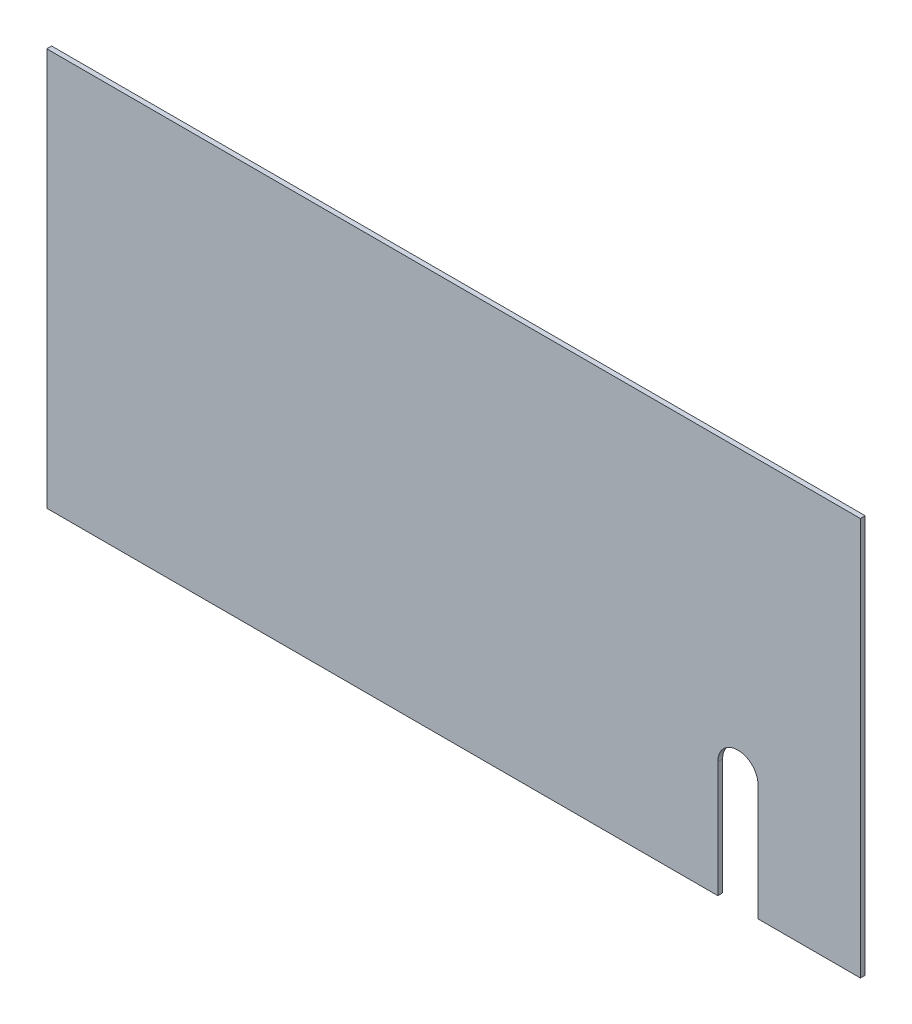
ISO-10303-21;
HEADER;
FILE_DESCRIPTION(('STEP AP214'),'2;1');
FILE_NAME('part.step','',(''),(''),'','','');
FILE_SCHEMA(('AUTOMOTIVE_DESIGN { 1 0 10303 214 1 1 1 1 }'));
ENDSEC;
DATA;
#1=APPLICATION_CONTEXT('core data for automotive mechanical design processes');
#2=APPLICATION_PROTOCOL_DEFINITION('international standard','automotive_design',2000,#1);
#3=PRODUCT_CONTEXT('',#1,'mechanical');
#4=PRODUCT('Part','Part','',(#3));
#5=PRODUCT_RELATED_PRODUCT_CATEGORY('part','',(#4));
#6=PRODUCT_DEFINITION_FORMATION('','',#4);
#7=PRODUCT_DEFINITION_CONTEXT('part definition',#1,'design');
#8=PRODUCT_DEFINITION('design','',#6,#7);
#9=PRODUCT_DEFINITION_SHAPE('','',#8);
#10=(LENGTH_UNIT() NAMED_UNIT(*) SI_UNIT(.MILLI.,.METRE.));
#11=(NAMED_UNIT(*) PLANE_ANGLE_UNIT() SI_UNIT($,.RADIAN.));
#12=(NAMED_UNIT(*) SI_UNIT($,.STERADIAN.) SOLID_ANGLE_UNIT());
#13=UNCERTAINTY_MEASURE_WITH_UNIT(LENGTH_MEASURE(1.E-05),#10,'distance_accuracy_value','');
#14=(GEOMETRIC_REPRESENTATION_CONTEXT(3) GLOBAL_UNCERTAINTY_ASSIGNED_CONTEXT((#13)) GLOBAL_UNIT_ASSIGNED_CONTEXT((#10,
#11,#12)) REPRESENTATION_CONTEXT('',''));
#15=CARTESIAN_POINT('',(0.,0.,0.));
#16=DIRECTION('',(0.,0.,1.));
#17=DIRECTION('',(1.,0.,0.));
#18=AXIS2_PLACEMENT_3D('',#15,#16,#17);
#19=CARTESIAN_POINT('',(230.5,-2.16617363985669,3.));
#20=DIRECTION('',(0.,1.,0.));
#21=DIRECTION('',(-1.,0.,0.));
#22=AXIS2_PLACEMENT_3D('',#19,#20,#21);
#23=PLANE('',#22);
#24=DIRECTION('',(1.,0.,0.));
#25=VECTOR('',#24,1.);
#26=CARTESIAN_POINT('',(230.5,-2.16617363985669,3.));
#27=LINE('',#26,#25);
#28=CARTESIAN_POINT('',(167.,-2.16617363985681,3.));
#29=VERTEX_POINT('',#28);
#30=CARTESIAN_POINT('',(230.5,-2.16617363985669,3.));
#31=VERTEX_POINT('',#30);
#32=EDGE_CURVE('E56',#29,#31,#27,.T.);
#33=ORIENTED_EDGE('',*,*,#32,.F.);
#34=DIRECTION('',(0.,0.,-1.));
#35=VECTOR('',#34,1.);
#36=CARTESIAN_POINT('',(167.,-2.16617363985671,3.));
#37=LINE('',#36,#35);
#38=CARTESIAN_POINT('',(167.,-2.16617363985682,0.));
#39=VERTEX_POINT('',#38);
#40=EDGE_CURVE('E132',#29,#39,#37,.T.);
#41=ORIENTED_EDGE('',*,*,#40,.T.);
#42=DIRECTION('',(1.,0.,0.));
#43=VECTOR('',#42,1.);
#44=CARTESIAN_POINT('',(230.5,-2.16617363985669,0.));
#45=LINE('',#44,#43);
#46=CARTESIAN_POINT('',(230.5,-2.16617363985669,0.));
#47=VERTEX_POINT('',#46);
#48=EDGE_CURVE('E78',#39,#47,#45,.T.);
#49=ORIENTED_EDGE('',*,*,#48,.T.);
#50=DIRECTION('',(0.,0.,-1.));
#51=VECTOR('',#50,1.);
#52=CARTESIAN_POINT('',(230.5,-2.16617363985669,3.));
#53=LINE('',#52,#51);
#54=EDGE_CURVE('E142',#31,#47,#53,.T.);
#55=ORIENTED_EDGE('',*,*,#54,.F.);
#56=EDGE_LOOP('',(#33,#41,#49,#55));
#57=FACE_BOUND('',#56,.T.);
#58=ADVANCED_FACE('F32',(#57),#23,.F.);
#59=CARTESIAN_POINT('',(230.5,-2.16617363985669,3.));
#60=DIRECTION('',(-1.,0.,0.));
#61=DIRECTION('',(0.,0.,1.));
#62=AXIS2_PLACEMENT_3D('',#59,#60,#61);
#63=PLANE('',#62);
#64=DIRECTION('',(0.,1.,0.));
#65=VECTOR('',#64,1.);
#66=CARTESIAN_POINT('',(230.5,-2.16617363985669,0.));
#67=LINE('',#66,#65);
#68=CARTESIAN_POINT('',(230.5,244.833826360143,0.));
#69=VERTEX_POINT('',#68);
#70=EDGE_CURVE('E134',#47,#69,#67,.T.);
#71=ORIENTED_EDGE('',*,*,#70,.T.);
#72=DIRECTION('',(0.,0.,-1.));
#73=VECTOR('',#72,1.);
#74=CARTESIAN_POINT('',(230.5,244.833826360143,3.));
#75=LINE('',#74,#73);
#76=CARTESIAN_POINT('',(230.5,244.833826360143,3.));
#77=VERTEX_POINT('',#76);
#78=EDGE_CURVE('E158',#77,#69,#75,.T.);
#79=ORIENTED_EDGE('',*,*,#78,.F.);
#80=DIRECTION('',(0.,1.,0.));
#81=VECTOR('',#80,1.);
#82=CARTESIAN_POINT('',(230.5,-2.16617363985669,3.));
#83=LINE('',#82,#81);
#84=EDGE_CURVE('E135',#31,#77,#83,.T.);
#85=ORIENTED_EDGE('',*,*,#84,.F.);
#86=ORIENTED_EDGE('',*,*,#54,.T.);
#87=EDGE_LOOP('',(#71,#79,#85,#86));
#88=FACE_BOUND('',#87,.T.);
#89=ADVANCED_FACE('F34',(#88),#63,.F.);
#90=CARTESIAN_POINT('',(230.5,244.833826360143,3.));
#91=DIRECTION('',(0.,-1.,0.));
#92=DIRECTION('',(1.,0.,0.));
#93=AXIS2_PLACEMENT_3D('',#90,#91,#92);
#94=PLANE('',#93);
#95=DIRECTION('',(-1.,0.,0.));
#96=VECTOR('',#95,1.);
#97=CARTESIAN_POINT('',(230.5,244.833826360143,0.));
#98=LINE('',#97,#96);
#99=CARTESIAN_POINT('',(-274.5,244.833826360143,0.));
#100=VERTEX_POINT('',#99);
#101=EDGE_CURVE('E145',#69,#100,#98,.T.);
#102=ORIENTED_EDGE('',*,*,#101,.T.);
#103=DIRECTION('',(0.,0.,-1.));
#104=VECTOR('',#103,1.);
#105=CARTESIAN_POINT('',(-274.5,244.833826360143,3.));
#106=LINE('',#105,#104);
#107=CARTESIAN_POINT('',(-274.5,244.833826360143,3.));
#108=VERTEX_POINT('',#107);
#109=EDGE_CURVE('E155',#108,#100,#106,.T.);
#110=ORIENTED_EDGE('',*,*,#109,.F.);
#111=DIRECTION('',(-1.,0.,0.));
#112=VECTOR('',#111,1.);
#113=CARTESIAN_POINT('',(230.5,244.833826360143,3.));
#114=LINE('',#113,#112);
#115=EDGE_CURVE('E86',#77,#108,#114,.T.);
#116=ORIENTED_EDGE('',*,*,#115,.F.);
#117=ORIENTED_EDGE('',*,*,#78,.T.);
#118=EDGE_LOOP('',(#102,#110,#116,#117));
#119=FACE_BOUND('',#118,.T.);
#120=ADVANCED_FACE('F171',(#119),#94,.F.);
#121=CARTESIAN_POINT('',(-274.5,-2.16617363985682,3.));
#122=DIRECTION('',(1.,0.,0.));
#123=DIRECTION('',(0.,0.,-1.));
#124=AXIS2_PLACEMENT_3D('',#121,#122,#123);
#125=PLANE('',#124);
#126=DIRECTION('',(0.,-1.,0.));
#127=VECTOR('',#126,1.);
#128=CARTESIAN_POINT('',(-274.5,-2.16617363985682,0.));
#129=LINE('',#128,#127);
#130=CARTESIAN_POINT('',(-274.5,-2.16617363985682,0.));
#131=VERTEX_POINT('',#130);
#132=EDGE_CURVE('E147',#100,#131,#129,.T.);
#133=ORIENTED_EDGE('',*,*,#132,.T.);
#134=DIRECTION('',(0.,0.,-1.));
#135=VECTOR('',#134,1.);
#136=CARTESIAN_POINT('',(-274.5,-2.16617363985682,3.));
#137=LINE('',#136,#135);
#138=CARTESIAN_POINT('',(-274.5,-2.16617363985682,3.));
#139=VERTEX_POINT('',#138);
#140=EDGE_CURVE('E152',#139,#131,#137,.T.);
#141=ORIENTED_EDGE('',*,*,#140,.F.);
#142=DIRECTION('',(0.,-1.,0.));
#143=VECTOR('',#142,1.);
#144=CARTESIAN_POINT('',(-274.5,-2.16617363985682,3.));
#145=LINE('',#144,#143);
#146=EDGE_CURVE('E139',#108,#139,#145,.T.);
#147=ORIENTED_EDGE('',*,*,#146,.F.);
#148=ORIENTED_EDGE('',*,*,#109,.T.);
#149=EDGE_LOOP('',(#133,#141,#147,#148));
#150=FACE_BOUND('',#149,.T.);
#151=ADVANCED_FACE('F174',(#150),#125,.F.);
#152=CARTESIAN_POINT('',(142.,-2.16617363985672,0.));
#153=VERTEX_POINT('',#152);
#154=EDGE_CURVE('E137',#131,#153,#45,.T.);
#155=ORIENTED_EDGE('',*,*,#154,.T.);
#156=DIRECTION('',(0.,0.,1.));
#157=VECTOR('',#156,1.);
#158=CARTESIAN_POINT('',(142.,-2.16617363985672,3.));
#159=LINE('',#158,#157);
#160=CARTESIAN_POINT('',(142.,-2.16617363985681,3.));
#161=VERTEX_POINT('',#160);
#162=EDGE_CURVE('E47',#153,#161,#159,.T.);
#163=ORIENTED_EDGE('',*,*,#162,.T.);
#164=EDGE_CURVE('E126',#139,#161,#27,.T.);
#165=ORIENTED_EDGE('',*,*,#164,.F.);
#166=ORIENTED_EDGE('',*,*,#140,.T.);
#167=EDGE_LOOP('',(#155,#163,#165,#166));
#168=FACE_BOUND('',#167,.T.);
#169=ADVANCED_FACE('F176',(#168),#23,.F.);
#170=CARTESIAN_POINT('',(0.,0.,3.));
#171=DIRECTION('',(0.,0.,1.));
#172=DIRECTION('',(1.,0.,0.));
#173=AXIS2_PLACEMENT_3D('',#170,#171,#172);
#174=PLANE('',#173);
#175=DIRECTION('',(0.,1.,0.));
#176=VECTOR('',#175,1.);
#177=CARTESIAN_POINT('',(167.,69.8338263601432,3.));
#178=LINE('',#177,#176);
#179=CARTESIAN_POINT('',(167.,69.8338263601432,3.));
#180=VERTEX_POINT('',#179);
#181=EDGE_CURVE('E115',#29,#180,#178,.T.);
#182=ORIENTED_EDGE('',*,*,#181,.F.);
#183=ORIENTED_EDGE('',*,*,#32,.T.);
#184=ORIENTED_EDGE('',*,*,#84,.T.);
#185=ORIENTED_EDGE('',*,*,#115,.T.);
#186=ORIENTED_EDGE('',*,*,#146,.T.);
#187=ORIENTED_EDGE('',*,*,#164,.T.);
#188=DIRECTION('',(0.,-1.,0.));
#189=VECTOR('',#188,1.);
#190=CARTESIAN_POINT('',(142.,69.8338263601432,3.));
#191=LINE('',#190,#189);
#192=CARTESIAN_POINT('',(142.,69.8338263601432,3.));
#193=VERTEX_POINT('',#192);
#194=EDGE_CURVE('E110',#193,#161,#191,.T.);
#195=ORIENTED_EDGE('',*,*,#194,.F.);
#196=CARTESIAN_POINT('',(154.5,69.8338263601432,3.));
#197=DIRECTION('',(0.,0.,1.));
#198=DIRECTION('',(1.,0.,0.));
#199=AXIS2_PLACEMENT_3D('',#196,#197,#198);
#200=CIRCLE('',#199,12.5);
#201=EDGE_CURVE('E118',#180,#193,#200,.T.);
#202=ORIENTED_EDGE('',*,*,#201,.F.);
#203=EDGE_LOOP('',(#182,#183,#184,#185,#186,#187,#195,#202));
#204=FACE_BOUND('',#203,.T.);
#205=ADVANCED_FACE('F124',(#204),#174,.T.);
#206=CARTESIAN_POINT('',(0.,0.,0.));
#207=DIRECTION('',(0.,0.,1.));
#208=DIRECTION('',(1.,0.,0.));
#209=AXIS2_PLACEMENT_3D('',#206,#207,#208);
#210=PLANE('',#209);
#211=ORIENTED_EDGE('',*,*,#48,.F.);
#212=DIRECTION('',(0.,1.,0.));
#213=VECTOR('',#212,1.);
#214=CARTESIAN_POINT('',(167.,0.,0.));
#215=LINE('',#214,#213);
#216=CARTESIAN_POINT('',(167.,69.8338263601432,0.));
#217=VERTEX_POINT('',#216);
#218=EDGE_CURVE('E11',#39,#217,#215,.T.);
#219=ORIENTED_EDGE('',*,*,#218,.T.);
#220=CARTESIAN_POINT('',(154.5,69.8338263601432,0.));
#221=DIRECTION('',(0.,0.,1.));
#222=DIRECTION('',(1.,0.,0.));
#223=AXIS2_PLACEMENT_3D('',#220,#221,#222);
#224=CIRCLE('',#223,12.5);
#225=CARTESIAN_POINT('',(142.,69.8338263601432,0.));
#226=VERTEX_POINT('',#225);
#227=EDGE_CURVE('E40',#217,#226,#224,.T.);
#228=ORIENTED_EDGE('',*,*,#227,.T.);
#229=DIRECTION('',(0.,-1.,0.));
#230=VECTOR('',#229,1.);
#231=CARTESIAN_POINT('',(142.,0.,0.));
#232=LINE('',#231,#230);
#233=EDGE_CURVE('E111',#226,#153,#232,.T.);
#234=ORIENTED_EDGE('',*,*,#233,.T.);
#235=ORIENTED_EDGE('',*,*,#154,.F.);
#236=ORIENTED_EDGE('',*,*,#132,.F.);
#237=ORIENTED_EDGE('',*,*,#101,.F.);
#238=ORIENTED_EDGE('',*,*,#70,.F.);
#239=EDGE_LOOP('',(#211,#219,#228,#234,#235,#236,#237,#238));
#240=FACE_BOUND('',#239,.T.);
#241=ADVANCED_FACE('F161',(#240),#210,.F.);
#242=CARTESIAN_POINT('',(154.5,69.8338263601432,-69.));
#243=DIRECTION('',(0.,0.,1.));
#244=DIRECTION('',(1.,0.,0.));
#245=AXIS2_PLACEMENT_3D('',#242,#243,#244);
#246=CYLINDRICAL_SURFACE('',#245,12.5);
#247=DIRECTION('',(0.,0.,1.));
#248=VECTOR('',#247,1.);
#249=CARTESIAN_POINT('',(167.,69.8338263601432,-69.));
#250=LINE('',#249,#248);
#251=EDGE_CURVE('E114',#217,#180,#250,.T.);
#252=ORIENTED_EDGE('',*,*,#251,.T.);
#253=ORIENTED_EDGE('',*,*,#201,.T.);
#254=DIRECTION('',(0.,0.,1.));
#255=VECTOR('',#254,1.);
#256=CARTESIAN_POINT('',(142.,69.8338263601432,-69.));
#257=LINE('',#256,#255);
#258=EDGE_CURVE('E106',#226,#193,#257,.T.);
#259=ORIENTED_EDGE('',*,*,#258,.F.);
#260=ORIENTED_EDGE('',*,*,#227,.F.);
#261=EDGE_LOOP('',(#252,#253,#259,#260));
#262=FACE_BOUND('',#261,.T.);
#263=ADVANCED_FACE('F119',(#262),#246,.F.);
#264=CARTESIAN_POINT('',(167.,69.8338263601432,-69.));
#265=DIRECTION('',(1.,0.,0.));
#266=DIRECTION('',(0.,0.,-1.));
#267=AXIS2_PLACEMENT_3D('',#264,#265,#266);
#268=PLANE('',#267);
#269=ORIENTED_EDGE('',*,*,#181,.T.);
#270=ORIENTED_EDGE('',*,*,#251,.F.);
#271=ORIENTED_EDGE('',*,*,#218,.F.);
#272=ORIENTED_EDGE('',*,*,#40,.F.);
#273=EDGE_LOOP('',(#269,#270,#271,#272));
#274=FACE_BOUND('',#273,.T.);
#275=ADVANCED_FACE('F164',(#274),#268,.F.);
#276=CARTESIAN_POINT('',(142.,69.8338263601432,-69.));
#277=DIRECTION('',(-1.,0.,0.));
#278=DIRECTION('',(0.,-1.,0.));
#279=AXIS2_PLACEMENT_3D('',#276,#277,#278);
#280=PLANE('',#279);
#281=ORIENTED_EDGE('',*,*,#233,.F.);
#282=ORIENTED_EDGE('',*,*,#258,.T.);
#283=ORIENTED_EDGE('',*,*,#194,.T.);
#284=ORIENTED_EDGE('',*,*,#162,.F.);
#285=EDGE_LOOP('',(#281,#282,#283,#284));
#286=FACE_BOUND('',#285,.T.);
#287=ADVANCED_FACE('F108',(#286),#280,.F.);
#288=CLOSED_SHELL('',(#58,#89,#120,#151,#169,#205,#241,#263,#275,#287));
#289=MANIFOLD_SOLID_BREP('B2',#288);
#290=ADVANCED_BREP_SHAPE_REPRESENTATION('',(#18,#289),#14);
#291=SHAPE_DEFINITION_REPRESENTATION(#9,#290);
ENDSEC;
END-ISO-10303-21;
